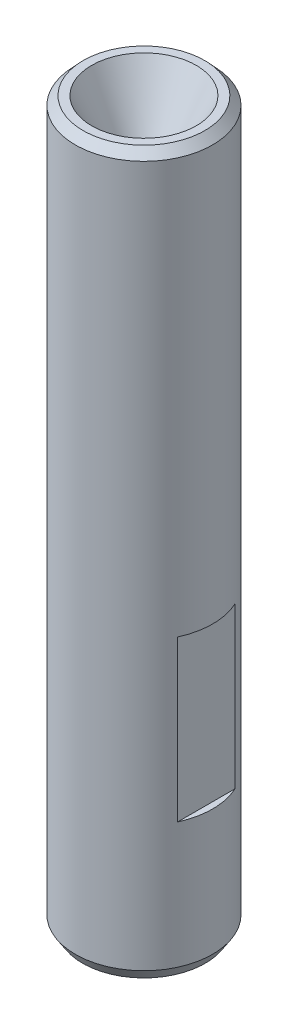
ISO-10303-21;
HEADER;
FILE_DESCRIPTION(('STEP AP214'),'2;1');
FILE_NAME('part.step','',(''),(''),'','','');
FILE_SCHEMA(('AUTOMOTIVE_DESIGN { 1 0 10303 214 1 1 1 1 }'));
ENDSEC;
DATA;
#1=APPLICATION_CONTEXT('core data for automotive mechanical design processes');
#2=APPLICATION_PROTOCOL_DEFINITION('international standard','automotive_design',2000,#1);
#3=PRODUCT_CONTEXT('',#1,'mechanical');
#4=PRODUCT('Part','Part','',(#3));
#5=PRODUCT_RELATED_PRODUCT_CATEGORY('part','',(#4));
#6=PRODUCT_DEFINITION_FORMATION('','',#4);
#7=PRODUCT_DEFINITION_CONTEXT('part definition',#1,'design');
#8=PRODUCT_DEFINITION('design','',#6,#7);
#9=PRODUCT_DEFINITION_SHAPE('','',#8);
#10=(LENGTH_UNIT() NAMED_UNIT(*) SI_UNIT(.MILLI.,.METRE.));
#11=(NAMED_UNIT(*) PLANE_ANGLE_UNIT() SI_UNIT($,.RADIAN.));
#12=(NAMED_UNIT(*) SI_UNIT($,.STERADIAN.) SOLID_ANGLE_UNIT());
#13=UNCERTAINTY_MEASURE_WITH_UNIT(LENGTH_MEASURE(1.E-05),#10,'distance_accuracy_value','');
#14=(GEOMETRIC_REPRESENTATION_CONTEXT(3) GLOBAL_UNCERTAINTY_ASSIGNED_CONTEXT((#13)) GLOBAL_UNIT_ASSIGNED_CONTEXT((#10,
#11,#12)) REPRESENTATION_CONTEXT('',''));
#15=CARTESIAN_POINT('',(0.,0.,0.));
#16=DIRECTION('',(0.,0.,1.));
#17=DIRECTION('',(1.,0.,0.));
#18=AXIS2_PLACEMENT_3D('',#15,#16,#17);
#19=CARTESIAN_POINT('',(-1.55,0.,0.));
#20=DIRECTION('',(0.,1.,0.));
#21=DIRECTION('',(-1.,0.,0.));
#22=AXIS2_PLACEMENT_3D('',#19,#20,#21);
#23=CYLINDRICAL_SURFACE('',#22,1.55);
#24=CARTESIAN_POINT('',(-1.55,0.,0.));
#25=DIRECTION('',(0.,1.,0.));
#26=DIRECTION('',(-1.,0.,0.));
#27=AXIS2_PLACEMENT_3D('',#24,#25,#26);
#28=CIRCLE('',#27,1.55);
#29=CARTESIAN_POINT('',(-3.1,0.,0.));
#30=VERTEX_POINT('',#29);
#31=EDGE_CURVE('E106',#30,#30,#28,.T.);
#32=ORIENTED_EDGE('',*,*,#31,.F.);
#33=EDGE_LOOP('',(#32));
#34=FACE_BOUND('',#33,.T.);
#35=CARTESIAN_POINT('',(-1.55,27.,0.));
#36=DIRECTION('',(0.,1.,0.));
#37=DIRECTION('',(-1.,0.,0.));
#38=AXIS2_PLACEMENT_3D('',#35,#36,#37);
#39=CIRCLE('',#38,1.55);
#40=CARTESIAN_POINT('',(-3.10000000000001,27.,0.));
#41=VERTEX_POINT('',#40);
#42=EDGE_CURVE('E130',#41,#41,#39,.T.);
#43=ORIENTED_EDGE('',*,*,#42,.T.);
#44=EDGE_LOOP('',(#43));
#45=FACE_BOUND('',#44,.T.);
#46=ADVANCED_FACE('F39',(#34,#45),#23,.F.);
#47=CARTESIAN_POINT('',(0.,0.,0.));
#48=DIRECTION('',(0.,1.,0.));
#49=DIRECTION('',(-1.,0.,0.));
#50=AXIS2_PLACEMENT_3D('',#47,#48,#49);
#51=PLANE('',#50);
#52=CARTESIAN_POINT('',(-1.55,0.,0.));
#53=DIRECTION('',(0.,1.,0.));
#54=DIRECTION('',(-1.,0.,0.));
#55=AXIS2_PLACEMENT_3D('',#52,#53,#54);
#56=CIRCLE('',#55,2.68113620898427);
#57=CARTESIAN_POINT('',(-4.23113620898427,0.,0.));
#58=VERTEX_POINT('',#57);
#59=EDGE_CURVE('E109',#58,#58,#56,.T.);
#60=ORIENTED_EDGE('',*,*,#59,.F.);
#61=EDGE_LOOP('',(#60));
#62=FACE_BOUND('',#61,.T.);
#63=ORIENTED_EDGE('',*,*,#31,.T.);
#64=EDGE_LOOP('',(#63));
#65=FACE_BOUND('',#64,.T.);
#66=ADVANCED_FACE('F150',(#62,#65),#51,.F.);
#67=CARTESIAN_POINT('',(-1.55,0.,0.));
#68=DIRECTION('',(0.,1.,0.));
#69=DIRECTION('',(-1.,0.,0.));
#70=AXIS2_PLACEMENT_3D('',#67,#68,#69);
#71=CONICAL_SURFACE('',#70,2.68113620898427,0.567699426223524);
#72=CARTESIAN_POINT('',(-1.55,0.5,0.));
#73=DIRECTION('',(0.,1.,0.));
#74=DIRECTION('',(-1.,0.,0.));
#75=AXIS2_PLACEMENT_3D('',#72,#73,#74);
#76=CIRCLE('',#75,3.);
#77=CARTESIAN_POINT('',(-4.55,0.499999999999999,0.));
#78=VERTEX_POINT('',#77);
#79=EDGE_CURVE('E112',#78,#78,#76,.T.);
#80=ORIENTED_EDGE('',*,*,#79,.F.);
#81=EDGE_LOOP('',(#80));
#82=FACE_BOUND('',#81,.T.);
#83=ORIENTED_EDGE('',*,*,#59,.T.);
#84=EDGE_LOOP('',(#83));
#85=FACE_BOUND('',#84,.T.);
#86=ADVANCED_FACE('F155',(#82,#85),#71,.T.);
#87=CARTESIAN_POINT('',(-1.55,0.,0.));
#88=DIRECTION('',(0.,1.,0.));
#89=DIRECTION('',(-1.,0.,0.));
#90=AXIS2_PLACEMENT_3D('',#87,#88,#89);
#91=CYLINDRICAL_SURFACE('',#90,3.);
#92=DIRECTION('',(0.,1.,0.));
#93=VECTOR('',#92,1.);
#94=CARTESIAN_POINT('',(1.17499999999999,0.,-1.25474100913298));
#95=LINE('',#94,#93);
#96=CARTESIAN_POINT('',(1.175,13.,-1.25474100913297));
#97=VERTEX_POINT('',#96);
#98=CARTESIAN_POINT('',(1.175,6.,-1.25474100913298));
#99=VERTEX_POINT('',#98);
#100=EDGE_CURVE('E82',#97,#99,#95,.F.);
#101=ORIENTED_EDGE('',*,*,#100,.T.);
#102=CARTESIAN_POINT('',(-1.55,6.,0.));
#103=DIRECTION('',(0.,-1.,0.));
#104=DIRECTION('',(0.,0.,-1.));
#105=AXIS2_PLACEMENT_3D('',#102,#103,#104);
#106=CIRCLE('',#105,3.);
#107=CARTESIAN_POINT('',(1.175,6.,1.25474100913298));
#108=VERTEX_POINT('',#107);
#109=EDGE_CURVE('E11',#99,#108,#106,.T.);
#110=ORIENTED_EDGE('',*,*,#109,.T.);
#111=DIRECTION('',(0.,1.,0.));
#112=VECTOR('',#111,1.);
#113=CARTESIAN_POINT('',(1.17499999999999,0.,1.25474100913298));
#114=LINE('',#113,#112);
#115=CARTESIAN_POINT('',(1.175,13.,1.25474100913297));
#116=VERTEX_POINT('',#115);
#117=EDGE_CURVE('E46',#108,#116,#114,.T.);
#118=ORIENTED_EDGE('',*,*,#117,.T.);
#119=CARTESIAN_POINT('',(-1.55,13.,0.));
#120=DIRECTION('',(0.,1.,0.));
#121=DIRECTION('',(0.,0.,1.));
#122=AXIS2_PLACEMENT_3D('',#119,#120,#121);
#123=CIRCLE('',#122,3.);
#124=EDGE_CURVE('E77',#116,#97,#123,.T.);
#125=ORIENTED_EDGE('',*,*,#124,.T.);
#126=EDGE_LOOP('',(#101,#110,#118,#125));
#127=FACE_BOUND('',#126,.T.);
#128=DIRECTION('',(0.,1.,0.));
#129=VECTOR('',#128,1.);
#130=CARTESIAN_POINT('',(-4.225,0.,-1.35807768555411));
#131=LINE('',#130,#129);
#132=CARTESIAN_POINT('',(-4.225,6.,-1.35807768555411));
#133=VERTEX_POINT('',#132);
#134=CARTESIAN_POINT('',(-4.225,13.,-1.35807768555411));
#135=VERTEX_POINT('',#134);
#136=EDGE_CURVE('E97',#133,#135,#131,.T.);
#137=ORIENTED_EDGE('',*,*,#136,.T.);
#138=CARTESIAN_POINT('',(-1.55,13.,0.));
#139=DIRECTION('',(0.,1.,0.));
#140=DIRECTION('',(0.,0.,1.));
#141=AXIS2_PLACEMENT_3D('',#138,#139,#140);
#142=CIRCLE('',#141,3.);
#143=CARTESIAN_POINT('',(-4.225,13.,1.35807768555411));
#144=VERTEX_POINT('',#143);
#145=EDGE_CURVE('E83',#135,#144,#142,.T.);
#146=ORIENTED_EDGE('',*,*,#145,.T.);
#147=DIRECTION('',(0.,1.,0.));
#148=VECTOR('',#147,1.);
#149=CARTESIAN_POINT('',(-4.225,0.,1.35807768555411));
#150=LINE('',#149,#148);
#151=CARTESIAN_POINT('',(-4.225,6.,1.35807768555411));
#152=VERTEX_POINT('',#151);
#153=EDGE_CURVE('E100',#144,#152,#150,.F.);
#154=ORIENTED_EDGE('',*,*,#153,.T.);
#155=CARTESIAN_POINT('',(-1.55,6.,0.));
#156=DIRECTION('',(0.,-1.,0.));
#157=DIRECTION('',(0.,0.,-1.));
#158=AXIS2_PLACEMENT_3D('',#155,#156,#157);
#159=CIRCLE('',#158,3.);
#160=EDGE_CURVE('E103',#152,#133,#159,.T.);
#161=ORIENTED_EDGE('',*,*,#160,.T.);
#162=EDGE_LOOP('',(#137,#146,#154,#161));
#163=FACE_BOUND('',#162,.T.);
#164=CARTESIAN_POINT('',(-1.55,31.13125,0.));
#165=DIRECTION('',(0.,1.,0.));
#166=DIRECTION('',(-1.,0.,0.));
#167=AXIS2_PLACEMENT_3D('',#164,#165,#166);
#168=CIRCLE('',#167,3.);
#169=CARTESIAN_POINT('',(-4.55000000000001,31.13125,0.));
#170=VERTEX_POINT('',#169);
#171=EDGE_CURVE('E115',#170,#170,#168,.T.);
#172=ORIENTED_EDGE('',*,*,#171,.F.);
#173=EDGE_LOOP('',(#172));
#174=FACE_BOUND('',#173,.T.);
#175=ORIENTED_EDGE('',*,*,#79,.T.);
#176=EDGE_LOOP('',(#175));
#177=FACE_BOUND('',#176,.T.);
#178=ADVANCED_FACE('F91',(#127,#163,#174,#177),#91,.T.);
#179=CARTESIAN_POINT('',(-1.55,31.13125,0.));
#180=DIRECTION('',(0.,-1.,0.));
#181=DIRECTION('',(1.,0.,0.));
#182=AXIS2_PLACEMENT_3D('',#179,#180,#181);
#183=CONICAL_SURFACE('',#182,3.,0.750324832864239);
#184=CARTESIAN_POINT('',(-1.55,31.5,0.));
#185=DIRECTION('',(0.,1.,0.));
#186=DIRECTION('',(-1.,0.,0.));
#187=AXIS2_PLACEMENT_3D('',#184,#185,#186);
#188=CIRCLE('',#187,2.65625);
#189=CARTESIAN_POINT('',(-4.20625000000001,31.5,0.));
#190=VERTEX_POINT('',#189);
#191=EDGE_CURVE('E118',#190,#190,#188,.T.);
#192=ORIENTED_EDGE('',*,*,#191,.F.);
#193=EDGE_LOOP('',(#192));
#194=FACE_BOUND('',#193,.T.);
#195=ORIENTED_EDGE('',*,*,#171,.T.);
#196=EDGE_LOOP('',(#195));
#197=FACE_BOUND('',#196,.T.);
#198=ADVANCED_FACE('F183',(#194,#197),#183,.T.);
#199=CARTESIAN_POINT('',(1.10625,31.5,0.));
#200=DIRECTION('',(0.,-1.,0.));
#201=DIRECTION('',(1.,0.,0.));
#202=AXIS2_PLACEMENT_3D('',#199,#200,#201);
#203=PLANE('',#202);
#204=CARTESIAN_POINT('',(-1.55,31.5,0.));
#205=DIRECTION('',(0.,1.,0.));
#206=DIRECTION('',(-1.,0.,0.));
#207=AXIS2_PLACEMENT_3D('',#204,#205,#206);
#208=CIRCLE('',#207,2.2875);
#209=CARTESIAN_POINT('',(-3.83750000000001,31.5,0.));
#210=VERTEX_POINT('',#209);
#211=EDGE_CURVE('E121',#210,#210,#208,.T.);
#212=ORIENTED_EDGE('',*,*,#211,.F.);
#213=EDGE_LOOP('',(#212));
#214=FACE_BOUND('',#213,.T.);
#215=ORIENTED_EDGE('',*,*,#191,.T.);
#216=EDGE_LOOP('',(#215));
#217=FACE_BOUND('',#216,.T.);
#218=ADVANCED_FACE('F177',(#214,#217),#203,.F.);
#219=CARTESIAN_POINT('',(-1.55,31.5,0.));
#220=DIRECTION('',(0.,1.,0.));
#221=DIRECTION('',(-1.,0.,0.));
#222=AXIS2_PLACEMENT_3D('',#219,#220,#221);
#223=CONICAL_SURFACE('',#222,2.2875,0.467639603763229);
#224=CARTESIAN_POINT('',(-1.55,29.,0.));
#225=DIRECTION('',(0.,1.,0.));
#226=DIRECTION('',(-1.,0.,0.));
#227=AXIS2_PLACEMENT_3D('',#224,#225,#226);
#228=CIRCLE('',#227,1.025);
#229=CARTESIAN_POINT('',(-2.57500000000001,29.,0.));
#230=VERTEX_POINT('',#229);
#231=EDGE_CURVE('E124',#230,#230,#228,.T.);
#232=ORIENTED_EDGE('',*,*,#231,.F.);
#233=EDGE_LOOP('',(#232));
#234=FACE_BOUND('',#233,.T.);
#235=ORIENTED_EDGE('',*,*,#211,.T.);
#236=EDGE_LOOP('',(#235));
#237=FACE_BOUND('',#236,.T.);
#238=ADVANCED_FACE('F171',(#234,#237),#223,.F.);
#239=CARTESIAN_POINT('',(-1.55,0.,0.));
#240=DIRECTION('',(0.,1.,0.));
#241=DIRECTION('',(-1.,0.,0.));
#242=AXIS2_PLACEMENT_3D('',#239,#240,#241);
#243=CYLINDRICAL_SURFACE('',#242,1.025);
#244=CARTESIAN_POINT('',(-1.55,27.,0.));
#245=DIRECTION('',(0.,1.,0.));
#246=DIRECTION('',(-1.,0.,0.));
#247=AXIS2_PLACEMENT_3D('',#244,#245,#246);
#248=CIRCLE('',#247,1.025);
#249=CARTESIAN_POINT('',(-2.57500000000001,27.,0.));
#250=VERTEX_POINT('',#249);
#251=EDGE_CURVE('E127',#250,#250,#248,.T.);
#252=ORIENTED_EDGE('',*,*,#251,.F.);
#253=EDGE_LOOP('',(#252));
#254=FACE_BOUND('',#253,.T.);
#255=ORIENTED_EDGE('',*,*,#231,.T.);
#256=EDGE_LOOP('',(#255));
#257=FACE_BOUND('',#256,.T.);
#258=ADVANCED_FACE('F165',(#254,#257),#243,.F.);
#259=CARTESIAN_POINT('',(0.,27.,0.));
#260=DIRECTION('',(0.,1.,0.));
#261=DIRECTION('',(-1.,0.,0.));
#262=AXIS2_PLACEMENT_3D('',#259,#260,#261);
#263=PLANE('',#262);
#264=ORIENTED_EDGE('',*,*,#42,.F.);
#265=EDGE_LOOP('',(#264));
#266=FACE_BOUND('',#265,.T.);
#267=ORIENTED_EDGE('',*,*,#251,.T.);
#268=EDGE_LOOP('',(#267));
#269=FACE_BOUND('',#268,.T.);
#270=ADVANCED_FACE('F161',(#266,#269),#263,.F.);
#271=CARTESIAN_POINT('',(-4.225,13.,-5.));
#272=DIRECTION('',(0.,1.,0.));
#273=DIRECTION('',(0.,0.,1.));
#274=AXIS2_PLACEMENT_3D('',#271,#272,#273);
#275=PLANE('',#274);
#276=DIRECTION('',(0.,0.,1.));
#277=VECTOR('',#276,1.);
#278=CARTESIAN_POINT('',(-4.225,13.,-5.));
#279=LINE('',#278,#277);
#280=EDGE_CURVE('E133',#135,#144,#279,.T.);
#281=ORIENTED_EDGE('',*,*,#280,.T.);
#282=ORIENTED_EDGE('',*,*,#145,.F.);
#283=EDGE_LOOP('',(#281,#282));
#284=FACE_BOUND('',#283,.T.);
#285=ADVANCED_FACE('F164',(#284),#275,.F.);
#286=CARTESIAN_POINT('',(-4.225,13.,-5.));
#287=DIRECTION('',(1.,0.,0.));
#288=DIRECTION('',(0.,1.,0.));
#289=AXIS2_PLACEMENT_3D('',#286,#287,#288);
#290=PLANE('',#289);
#291=DIRECTION('',(0.,0.,1.));
#292=VECTOR('',#291,1.);
#293=CARTESIAN_POINT('',(-4.225,6.,-5.));
#294=LINE('',#293,#292);
#295=EDGE_CURVE('E59',#133,#152,#294,.T.);
#296=ORIENTED_EDGE('',*,*,#295,.T.);
#297=ORIENTED_EDGE('',*,*,#153,.F.);
#298=ORIENTED_EDGE('',*,*,#280,.F.);
#299=ORIENTED_EDGE('',*,*,#136,.F.);
#300=EDGE_LOOP('',(#296,#297,#298,#299));
#301=FACE_BOUND('',#300,.T.);
#302=ADVANCED_FACE('F147',(#301),#290,.F.);
#303=CARTESIAN_POINT('',(-4.63171916692667,6.,-5.));
#304=DIRECTION('',(0.,-1.,0.));
#305=DIRECTION('',(0.,0.,-1.));
#306=AXIS2_PLACEMENT_3D('',#303,#304,#305);
#307=PLANE('',#306);
#308=ORIENTED_EDGE('',*,*,#295,.F.);
#309=ORIENTED_EDGE('',*,*,#160,.F.);
#310=EDGE_LOOP('',(#308,#309));
#311=FACE_BOUND('',#310,.T.);
#312=ADVANCED_FACE('F140',(#311),#307,.F.);
#313=CARTESIAN_POINT('',(1.58171916692666,6.,-5.));
#314=DIRECTION('',(0.,-1.,0.));
#315=DIRECTION('',(0.,0.,-1.));
#316=AXIS2_PLACEMENT_3D('',#313,#314,#315);
#317=PLANE('',#316);
#318=DIRECTION('',(0.,0.,1.));
#319=VECTOR('',#318,1.);
#320=CARTESIAN_POINT('',(1.175,6.,-5.));
#321=LINE('',#320,#319);
#322=EDGE_CURVE('E89',#99,#108,#321,.T.);
#323=ORIENTED_EDGE('',*,*,#322,.T.);
#324=ORIENTED_EDGE('',*,*,#109,.F.);
#325=EDGE_LOOP('',(#323,#324));
#326=FACE_BOUND('',#325,.T.);
#327=ADVANCED_FACE('F138',(#326),#317,.F.);
#328=CARTESIAN_POINT('',(1.175,13.,-5.));
#329=DIRECTION('',(-1.,0.,0.));
#330=DIRECTION('',(0.,-1.,0.));
#331=AXIS2_PLACEMENT_3D('',#328,#329,#330);
#332=PLANE('',#331);
#333=ORIENTED_EDGE('',*,*,#322,.F.);
#334=ORIENTED_EDGE('',*,*,#100,.F.);
#335=DIRECTION('',(0.,0.,1.));
#336=VECTOR('',#335,1.);
#337=CARTESIAN_POINT('',(1.175,13.,-5.));
#338=LINE('',#337,#336);
#339=EDGE_CURVE('E52',#97,#116,#338,.T.);
#340=ORIENTED_EDGE('',*,*,#339,.T.);
#341=ORIENTED_EDGE('',*,*,#117,.F.);
#342=EDGE_LOOP('',(#333,#334,#340,#341));
#343=FACE_BOUND('',#342,.T.);
#344=ADVANCED_FACE('F87',(#343),#332,.F.);
#345=CARTESIAN_POINT('',(1.175,13.,-5.));
#346=DIRECTION('',(0.,1.,0.));
#347=DIRECTION('',(0.,0.,1.));
#348=AXIS2_PLACEMENT_3D('',#345,#346,#347);
#349=PLANE('',#348);
#350=ORIENTED_EDGE('',*,*,#339,.F.);
#351=ORIENTED_EDGE('',*,*,#124,.F.);
#352=EDGE_LOOP('',(#350,#351));
#353=FACE_BOUND('',#352,.T.);
#354=ADVANCED_FACE('F78',(#353),#349,.F.);
#355=CLOSED_SHELL('',(#46,#66,#86,#178,#198,#218,#238,#258,#270,#285,#302,#312,#327,#344,#354));
#356=MANIFOLD_SOLID_BREP('B2',#355);
#357=ADVANCED_BREP_SHAPE_REPRESENTATION('',(#18,#356),#14);
#358=SHAPE_DEFINITION_REPRESENTATION(#9,#357);
ENDSEC;
END-ISO-10303-21;
